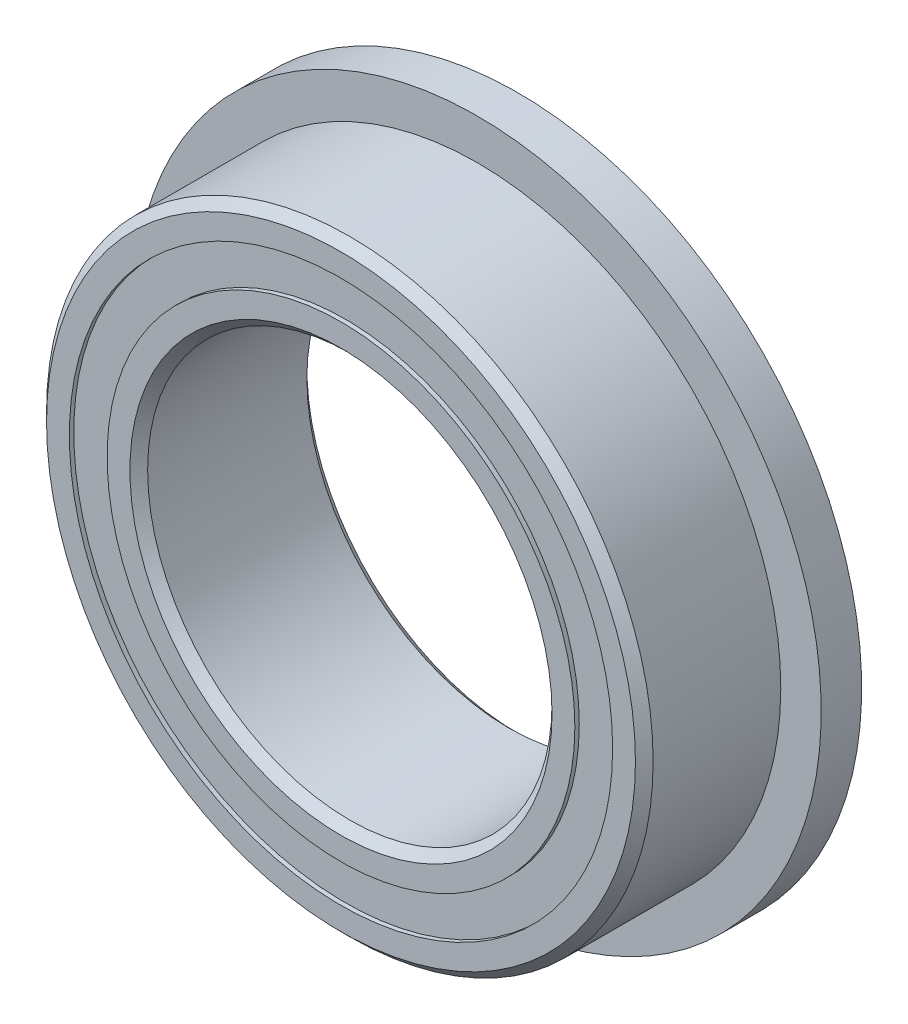
ISO-10303-21;
HEADER;
FILE_DESCRIPTION(('STEP AP214'),'2;1');
FILE_NAME('part.step','',(''),(''),'','','');
FILE_SCHEMA(('AUTOMOTIVE_DESIGN { 1 0 10303 214 1 1 1 1 }'));
ENDSEC;
DATA;
#1=APPLICATION_CONTEXT('core data for automotive mechanical design processes');
#2=APPLICATION_PROTOCOL_DEFINITION('international standard','automotive_design',2000,#1);
#3=PRODUCT_CONTEXT('',#1,'mechanical');
#4=PRODUCT('Part','Part','',(#3));
#5=PRODUCT_RELATED_PRODUCT_CATEGORY('part','',(#4));
#6=PRODUCT_DEFINITION_FORMATION('','',#4);
#7=PRODUCT_DEFINITION_CONTEXT('part definition',#1,'design');
#8=PRODUCT_DEFINITION('design','',#6,#7);
#9=PRODUCT_DEFINITION_SHAPE('','',#8);
#10=(LENGTH_UNIT() NAMED_UNIT(*) SI_UNIT(.MILLI.,.METRE.));
#11=(NAMED_UNIT(*) PLANE_ANGLE_UNIT() SI_UNIT($,.RADIAN.));
#12=(NAMED_UNIT(*) SI_UNIT($,.STERADIAN.) SOLID_ANGLE_UNIT());
#13=UNCERTAINTY_MEASURE_WITH_UNIT(LENGTH_MEASURE(1.E-05),#10,'distance_accuracy_value','');
#14=(GEOMETRIC_REPRESENTATION_CONTEXT(3) GLOBAL_UNCERTAINTY_ASSIGNED_CONTEXT((#13)) GLOBAL_UNIT_ASSIGNED_CONTEXT((#10,
#11,#12)) REPRESENTATION_CONTEXT('',''));
#15=CARTESIAN_POINT('',(0.,0.,0.));
#16=DIRECTION('',(0.,0.,1.));
#17=DIRECTION('',(1.,0.,0.));
#18=AXIS2_PLACEMENT_3D('',#15,#16,#17);
#19=CARTESIAN_POINT('',(0.,5.37362637362637,-1.6625));
#20=DIRECTION('',(0.,0.,1.));
#21=DIRECTION('',(1.,0.,0.));
#22=AXIS2_PLACEMENT_3D('',#19,#20,#21);
#23=PLANE('',#22);
#24=CARTESIAN_POINT('',(0.,0.,-1.6625));
#25=DIRECTION('',(0.,0.,1.));
#26=DIRECTION('',(1.,0.,0.));
#27=AXIS2_PLACEMENT_3D('',#24,#25,#26);
#28=CIRCLE('',#27,5.37362637362637);
#29=CARTESIAN_POINT('',(5.37362637362637,0.,-1.6625));
#30=VERTEX_POINT('',#29);
#31=EDGE_CURVE('E55',#30,#30,#28,.T.);
#32=ORIENTED_EDGE('',*,*,#31,.F.);
#33=EDGE_LOOP('',(#32));
#34=FACE_BOUND('',#33,.T.);
#35=CARTESIAN_POINT('',(0.,0.,-1.6625));
#36=DIRECTION('',(0.,0.,1.));
#37=DIRECTION('',(1.,0.,0.));
#38=AXIS2_PLACEMENT_3D('',#35,#36,#37);
#39=CIRCLE('',#38,4.62637362637363);
#40=CARTESIAN_POINT('',(4.62637362637363,0.,-1.6625));
#41=VERTEX_POINT('',#40);
#42=EDGE_CURVE('E11',#41,#41,#39,.T.);
#43=ORIENTED_EDGE('',*,*,#42,.T.);
#44=EDGE_LOOP('',(#43));
#45=FACE_BOUND('',#44,.T.);
#46=ADVANCED_FACE('F41',(#34,#45),#23,.F.);
#47=CARTESIAN_POINT('',(0.,0.,1.75));
#48=DIRECTION('',(0.,0.,1.));
#49=DIRECTION('',(1.,0.,0.));
#50=AXIS2_PLACEMENT_3D('',#47,#48,#49);
#51=CYLINDRICAL_SURFACE('',#50,4.62637362637363);
#52=ORIENTED_EDGE('',*,*,#42,.F.);
#53=EDGE_LOOP('',(#52));
#54=FACE_BOUND('',#53,.T.);
#55=CARTESIAN_POINT('',(0.,0.,-0.862864380232568));
#56=DIRECTION('',(0.,0.,1.));
#57=DIRECTION('',(1.,0.,0.));
#58=AXIS2_PLACEMENT_3D('',#55,#56,#57);
#59=CIRCLE('',#58,4.62637362637363);
#60=CARTESIAN_POINT('',(4.62637362637363,0.,-0.862864380232568));
#61=VERTEX_POINT('',#60);
#62=EDGE_CURVE('E47',#61,#61,#59,.T.);
#63=ORIENTED_EDGE('',*,*,#62,.T.);
#64=EDGE_LOOP('',(#63));
#65=FACE_BOUND('',#64,.T.);
#66=ADVANCED_FACE('F64',(#54,#65),#51,.F.);
#67=CARTESIAN_POINT('',(0.,5.37362637362637,-0.862864380232568));
#68=DIRECTION('',(0.,0.,-1.));
#69=DIRECTION('',(-1.,0.,0.));
#70=AXIS2_PLACEMENT_3D('',#67,#68,#69);
#71=PLANE('',#70);
#72=ORIENTED_EDGE('',*,*,#62,.F.);
#73=EDGE_LOOP('',(#72));
#74=FACE_BOUND('',#73,.T.);
#75=CARTESIAN_POINT('',(0.,0.,-0.862864380232568));
#76=DIRECTION('',(0.,0.,1.));
#77=DIRECTION('',(1.,0.,0.));
#78=AXIS2_PLACEMENT_3D('',#75,#76,#77);
#79=CIRCLE('',#78,5.37362637362637);
#80=CARTESIAN_POINT('',(5.37362637362637,0.,-0.862864380232568));
#81=VERTEX_POINT('',#80);
#82=EDGE_CURVE('E51',#81,#81,#79,.T.);
#83=ORIENTED_EDGE('',*,*,#82,.T.);
#84=EDGE_LOOP('',(#83));
#85=FACE_BOUND('',#84,.T.);
#86=ADVANCED_FACE('F68',(#74,#85),#71,.F.);
#87=CARTESIAN_POINT('',(0.,0.,1.75));
#88=DIRECTION('',(0.,0.,1.));
#89=DIRECTION('',(1.,0.,0.));
#90=AXIS2_PLACEMENT_3D('',#87,#88,#89);
#91=CYLINDRICAL_SURFACE('',#90,5.37362637362637);
#92=ORIENTED_EDGE('',*,*,#82,.F.);
#93=EDGE_LOOP('',(#92));
#94=FACE_BOUND('',#93,.T.);
#95=ORIENTED_EDGE('',*,*,#31,.T.);
#96=EDGE_LOOP('',(#95));
#97=FACE_BOUND('',#96,.T.);
#98=ADVANCED_FACE('F61',(#94,#97),#91,.T.);
#99=CLOSED_SHELL('',(#46,#66,#86,#98));
#100=MANIFOLD_SOLID_BREP('B2',#99);
#101=CARTESIAN_POINT('',(0.,5.37362637362637,1.6625));
#102=DIRECTION('',(0.,0.,-1.));
#103=DIRECTION('',(-1.,0.,0.));
#104=AXIS2_PLACEMENT_3D('',#101,#102,#103);
#105=PLANE('',#104);
#106=CARTESIAN_POINT('',(0.,0.,1.6625));
#107=DIRECTION('',(0.,0.,1.));
#108=DIRECTION('',(1.,0.,0.));
#109=AXIS2_PLACEMENT_3D('',#106,#107,#108);
#110=CIRCLE('',#109,4.62637362637363);
#111=CARTESIAN_POINT('',(4.62637362637363,0.,1.6625));
#112=VERTEX_POINT('',#111);
#113=EDGE_CURVE('E40',#112,#112,#110,.T.);
#114=ORIENTED_EDGE('',*,*,#113,.F.);
#115=EDGE_LOOP('',(#114));
#116=FACE_BOUND('',#115,.T.);
#117=CARTESIAN_POINT('',(0.,0.,1.6625));
#118=DIRECTION('',(0.,0.,1.));
#119=DIRECTION('',(1.,0.,0.));
#120=AXIS2_PLACEMENT_3D('',#117,#118,#119);
#121=CIRCLE('',#120,5.37362637362637);
#122=CARTESIAN_POINT('',(5.37362637362637,0.,1.6625));
#123=VERTEX_POINT('',#122);
#124=EDGE_CURVE('E122',#123,#123,#121,.T.);
#125=ORIENTED_EDGE('',*,*,#124,.T.);
#126=EDGE_LOOP('',(#125));
#127=FACE_BOUND('',#126,.T.);
#128=ADVANCED_FACE('F108',(#116,#127),#105,.F.);
#129=CARTESIAN_POINT('',(0.,0.,1.75));
#130=DIRECTION('',(0.,0.,1.));
#131=DIRECTION('',(1.,0.,0.));
#132=AXIS2_PLACEMENT_3D('',#129,#130,#131);
#133=CYLINDRICAL_SURFACE('',#132,4.62637362637363);
#134=CARTESIAN_POINT('',(0.,0.,0.862864380232567));
#135=DIRECTION('',(0.,0.,1.));
#136=DIRECTION('',(1.,0.,0.));
#137=AXIS2_PLACEMENT_3D('',#134,#135,#136);
#138=CIRCLE('',#137,4.62637362637363);
#139=CARTESIAN_POINT('',(4.62637362637363,0.,0.862864380232567));
#140=VERTEX_POINT('',#139);
#141=EDGE_CURVE('E114',#140,#140,#138,.T.);
#142=ORIENTED_EDGE('',*,*,#141,.F.);
#143=EDGE_LOOP('',(#142));
#144=FACE_BOUND('',#143,.T.);
#145=ORIENTED_EDGE('',*,*,#113,.T.);
#146=EDGE_LOOP('',(#145));
#147=FACE_BOUND('',#146,.T.);
#148=ADVANCED_FACE('F137',(#144,#147),#133,.F.);
#149=CARTESIAN_POINT('',(0.,5.37362637362637,0.862864380232567));
#150=DIRECTION('',(0.,0.,1.));
#151=DIRECTION('',(1.,0.,0.));
#152=AXIS2_PLACEMENT_3D('',#149,#150,#151);
#153=PLANE('',#152);
#154=CARTESIAN_POINT('',(0.,0.,0.862864380232567));
#155=DIRECTION('',(0.,0.,1.));
#156=DIRECTION('',(1.,0.,0.));
#157=AXIS2_PLACEMENT_3D('',#154,#155,#156);
#158=CIRCLE('',#157,5.37362637362637);
#159=CARTESIAN_POINT('',(5.37362637362637,0.,0.862864380232567));
#160=VERTEX_POINT('',#159);
#161=EDGE_CURVE('E118',#160,#160,#158,.T.);
#162=ORIENTED_EDGE('',*,*,#161,.F.);
#163=EDGE_LOOP('',(#162));
#164=FACE_BOUND('',#163,.T.);
#165=ORIENTED_EDGE('',*,*,#141,.T.);
#166=EDGE_LOOP('',(#165));
#167=FACE_BOUND('',#166,.T.);
#168=ADVANCED_FACE('F132',(#164,#167),#153,.F.);
#169=CARTESIAN_POINT('',(0.,0.,1.75));
#170=DIRECTION('',(0.,0.,1.));
#171=DIRECTION('',(1.,0.,0.));
#172=AXIS2_PLACEMENT_3D('',#169,#170,#171);
#173=CYLINDRICAL_SURFACE('',#172,5.37362637362637);
#174=ORIENTED_EDGE('',*,*,#124,.F.);
#175=EDGE_LOOP('',(#174));
#176=FACE_BOUND('',#175,.T.);
#177=ORIENTED_EDGE('',*,*,#161,.T.);
#178=EDGE_LOOP('',(#177));
#179=FACE_BOUND('',#178,.T.);
#180=ADVANCED_FACE('F129',(#176,#179),#173,.T.);
#181=CLOSED_SHELL('',(#128,#148,#168,#180));
#182=MANIFOLD_SOLID_BREP('B6',#181);
#183=CARTESIAN_POINT('',(-2.49999999999994,4.33012701892223,0.));
#184=DIRECTION('',(0.,0.,1.));
#185=DIRECTION('',(0.499999999999989,-0.866025403784445,0.));
#186=AXIS2_PLACEMENT_3D('',#183,#184,#185);
#187=SPHERICAL_SURFACE('',#186,0.862864380232568);
#188=CARTESIAN_POINT('',(-2.49999999999994,4.33012701892223,0.862864380232567));
#189=VERTEX_POINT('',#188);
#190=VERTEX_LOOP('',#189);
#191=FACE_BOUND('',#190,.T.);
#192=ADVANCED_FACE('F175',(#191),#187,.T.);
#193=CLOSED_SHELL('',(#192));
#194=MANIFOLD_SOLID_BREP('B35',#193);
#195=CARTESIAN_POINT('',(-4.33012701892216,2.50000000000005,0.));
#196=DIRECTION('',(0.,0.,1.));
#197=DIRECTION('',(0.866025403784433,-0.50000000000001,0.));
#198=AXIS2_PLACEMENT_3D('',#195,#196,#197);
#199=SPHERICAL_SURFACE('',#198,0.862864380232568);
#200=CARTESIAN_POINT('',(-4.33012701892216,2.50000000000005,0.862864380232567));
#201=VERTEX_POINT('',#200);
#202=VERTEX_LOOP('',#201);
#203=FACE_BOUND('',#202,.T.);
#204=ADVANCED_FACE('F195',(#203),#199,.T.);
#205=CLOSED_SHELL('',(#204));
#206=MANIFOLD_SOLID_BREP('B104',#205);
#207=CARTESIAN_POINT('',(-5.,0.,0.));
#208=DIRECTION('',(0.,0.,1.));
#209=DIRECTION('',(1.,0.,0.));
#210=AXIS2_PLACEMENT_3D('',#207,#208,#209);
#211=SPHERICAL_SURFACE('',#210,0.862864380232568);
#212=CARTESIAN_POINT('',(-5.,0.,0.862864380232567));
#213=VERTEX_POINT('',#212);
#214=VERTEX_LOOP('',#213);
#215=FACE_BOUND('',#214,.T.);
#216=ADVANCED_FACE('F215',(#215),#211,.T.);
#217=CLOSED_SHELL('',(#216));
#218=MANIFOLD_SOLID_BREP('B171',#217);
#219=CARTESIAN_POINT('',(-4.33012701892222,-2.49999999999996,0.));
#220=DIRECTION('',(0.,0.,1.));
#221=DIRECTION('',(0.866025403784443,0.499999999999992,0.));
#222=AXIS2_PLACEMENT_3D('',#219,#220,#221);
#223=SPHERICAL_SURFACE('',#222,0.862864380232568);
#224=CARTESIAN_POINT('',(-4.33012701892222,-2.49999999999996,0.862864380232567));
#225=VERTEX_POINT('',#224);
#226=VERTEX_LOOP('',#225);
#227=FACE_BOUND('',#226,.T.);
#228=ADVANCED_FACE('F235',(#227),#223,.T.);
#229=CLOSED_SHELL('',(#228));
#230=MANIFOLD_SOLID_BREP('B191',#229);
#231=CARTESIAN_POINT('',(-2.50000000000004,-4.33012701892217,0.));
#232=DIRECTION('',(0.,0.,1.));
#233=DIRECTION('',(0.500000000000007,0.866025403784435,0.));
#234=AXIS2_PLACEMENT_3D('',#231,#232,#233);
#235=SPHERICAL_SURFACE('',#234,0.862864380232568);
#236=CARTESIAN_POINT('',(-2.50000000000004,-4.33012701892217,0.862864380232567));
#237=VERTEX_POINT('',#236);
#238=VERTEX_LOOP('',#237);
#239=FACE_BOUND('',#238,.T.);
#240=ADVANCED_FACE('F255',(#239),#235,.T.);
#241=CLOSED_SHELL('',(#240));
#242=MANIFOLD_SOLID_BREP('B211',#241);
#243=CARTESIAN_POINT('',(0.,-5.,0.));
#244=DIRECTION('',(0.,0.,1.));
#245=DIRECTION('',(0.,1.,0.));
#246=AXIS2_PLACEMENT_3D('',#243,#244,#245);
#247=SPHERICAL_SURFACE('',#246,0.862864380232568);
#248=CARTESIAN_POINT('',(0.,-5.,0.862864380232567));
#249=VERTEX_POINT('',#248);
#250=VERTEX_LOOP('',#249);
#251=FACE_BOUND('',#250,.T.);
#252=ADVANCED_FACE('F275',(#251),#247,.T.);
#253=CLOSED_SHELL('',(#252));
#254=MANIFOLD_SOLID_BREP('B231',#253);
#255=CARTESIAN_POINT('',(2.49999999999997,-4.33012701892221,0.));
#256=DIRECTION('',(0.,0.,1.));
#257=DIRECTION('',(-0.499999999999995,0.866025403784442,0.));
#258=AXIS2_PLACEMENT_3D('',#255,#256,#257);
#259=SPHERICAL_SURFACE('',#258,0.862864380232568);
#260=CARTESIAN_POINT('',(2.49999999999997,-4.33012701892221,0.862864380232567));
#261=VERTEX_POINT('',#260);
#262=VERTEX_LOOP('',#261);
#263=FACE_BOUND('',#262,.T.);
#264=ADVANCED_FACE('F295',(#263),#259,.T.);
#265=CLOSED_SHELL('',(#264));
#266=MANIFOLD_SOLID_BREP('B251',#265);
#267=CARTESIAN_POINT('',(4.33012701892218,-2.50000000000002,0.));
#268=DIRECTION('',(0.,0.,1.));
#269=DIRECTION('',(-0.866025403784436,0.500000000000004,0.));
#270=AXIS2_PLACEMENT_3D('',#267,#268,#269);
#271=SPHERICAL_SURFACE('',#270,0.862864380232568);
#272=CARTESIAN_POINT('',(4.33012701892218,-2.50000000000002,0.862864380232567));
#273=VERTEX_POINT('',#272);
#274=VERTEX_LOOP('',#273);
#275=FACE_BOUND('',#274,.T.);
#276=ADVANCED_FACE('F315',(#275),#271,.T.);
#277=CLOSED_SHELL('',(#276));
#278=MANIFOLD_SOLID_BREP('B271',#277);
#279=CARTESIAN_POINT('',(5.,0.,0.));
#280=DIRECTION('',(0.,0.,1.));
#281=DIRECTION('',(-1.,0.,0.));
#282=AXIS2_PLACEMENT_3D('',#279,#280,#281);
#283=SPHERICAL_SURFACE('',#282,0.862864380232568);
#284=CARTESIAN_POINT('',(5.,0.,0.862864380232567));
#285=VERTEX_POINT('',#284);
#286=VERTEX_LOOP('',#285);
#287=FACE_BOUND('',#286,.T.);
#288=ADVANCED_FACE('F335',(#287),#283,.T.);
#289=CLOSED_SHELL('',(#288));
#290=MANIFOLD_SOLID_BREP('B291',#289);
#291=CARTESIAN_POINT('',(4.3301270189222,2.49999999999999,0.));
#292=DIRECTION('',(0.,0.,1.));
#293=DIRECTION('',(-0.86602540378444,-0.499999999999998,0.));
#294=AXIS2_PLACEMENT_3D('',#291,#292,#293);
#295=SPHERICAL_SURFACE('',#294,0.862864380232568);
#296=CARTESIAN_POINT('',(4.3301270189222,2.49999999999999,0.862864380232567));
#297=VERTEX_POINT('',#296);
#298=VERTEX_LOOP('',#297);
#299=FACE_BOUND('',#298,.T.);
#300=ADVANCED_FACE('F355',(#299),#295,.T.);
#301=CLOSED_SHELL('',(#300));
#302=MANIFOLD_SOLID_BREP('B311',#301);
#303=CARTESIAN_POINT('',(2.50000000000001,4.33012701892219,0.));
#304=DIRECTION('',(0.,0.,1.));
#305=DIRECTION('',(-0.500000000000001,-0.866025403784438,0.));
#306=AXIS2_PLACEMENT_3D('',#303,#304,#305);
#307=SPHERICAL_SURFACE('',#306,0.862864380232568);
#308=CARTESIAN_POINT('',(2.50000000000001,4.33012701892219,0.862864380232567));
#309=VERTEX_POINT('',#308);
#310=VERTEX_LOOP('',#309);
#311=FACE_BOUND('',#310,.T.);
#312=ADVANCED_FACE('F375',(#311),#307,.T.);
#313=CLOSED_SHELL('',(#312));
#314=MANIFOLD_SOLID_BREP('B331',#313);
#315=CARTESIAN_POINT('',(0.,5.,0.));
#316=DIRECTION('',(0.,0.,1.));
#317=DIRECTION('',(0.,-1.,0.));
#318=AXIS2_PLACEMENT_3D('',#315,#316,#317);
#319=SPHERICAL_SURFACE('',#318,0.862864380232568);
#320=CARTESIAN_POINT('',(0.,5.,0.862864380232567));
#321=VERTEX_POINT('',#320);
#322=VERTEX_LOOP('',#321);
#323=FACE_BOUND('',#322,.T.);
#324=ADVANCED_FACE('F397',(#323),#319,.T.);
#325=CLOSED_SHELL('',(#324));
#326=MANIFOLD_SOLID_BREP('B351',#325);
#327=CARTESIAN_POINT('',(0.,4.62637362637363,1.75));
#328=DIRECTION('',(0.,0.,-1.));
#329=DIRECTION('',(-1.,0.,0.));
#330=AXIS2_PLACEMENT_3D('',#327,#328,#329);
#331=PLANE('',#330);
#332=CARTESIAN_POINT('',(0.,0.,1.75));
#333=DIRECTION('',(0.,0.,1.));
#334=DIRECTION('',(1.,0.,0.));
#335=AXIS2_PLACEMENT_3D('',#332,#333,#334);
#336=CIRCLE('',#335,4.175);
#337=CARTESIAN_POINT('',(4.175,0.,1.75));
#338=VERTEX_POINT('',#337);
#339=EDGE_CURVE('E444',#338,#338,#336,.T.);
#340=ORIENTED_EDGE('',*,*,#339,.F.);
#341=EDGE_LOOP('',(#340));
#342=FACE_BOUND('',#341,.T.);
#343=CARTESIAN_POINT('',(0.,0.,1.75));
#344=DIRECTION('',(0.,0.,1.));
#345=DIRECTION('',(1.,0.,0.));
#346=AXIS2_PLACEMENT_3D('',#343,#344,#345);
#347=CIRCLE('',#346,4.62637362637363);
#348=CARTESIAN_POINT('',(4.62637362637363,0.,1.75));
#349=VERTEX_POINT('',#348);
#350=EDGE_CURVE('E396',#349,#349,#347,.T.);
#351=ORIENTED_EDGE('',*,*,#350,.T.);
#352=EDGE_LOOP('',(#351));
#353=FACE_BOUND('',#352,.T.);
#354=ADVANCED_FACE('F416',(#342,#353),#331,.F.);
#355=CARTESIAN_POINT('',(0.,0.,1.75));
#356=DIRECTION('',(0.,0.,1.));
#357=DIRECTION('',(1.,0.,0.));
#358=AXIS2_PLACEMENT_3D('',#355,#356,#357);
#359=CYLINDRICAL_SURFACE('',#358,4.62637362637363);
#360=ORIENTED_EDGE('',*,*,#350,.F.);
#361=EDGE_LOOP('',(#360));
#362=FACE_BOUND('',#361,.T.);
#363=CARTESIAN_POINT('',(0.,0.,0.777777777777777));
#364=DIRECTION('',(0.,0.,1.));
#365=DIRECTION('',(1.,0.,0.));
#366=AXIS2_PLACEMENT_3D('',#363,#364,#365);
#367=CIRCLE('',#366,4.62637362637363);
#368=CARTESIAN_POINT('',(4.62637362637363,0.,0.777777777777777));
#369=VERTEX_POINT('',#368);
#370=EDGE_CURVE('E422',#369,#369,#367,.T.);
#371=ORIENTED_EDGE('',*,*,#370,.T.);
#372=EDGE_LOOP('',(#371));
#373=FACE_BOUND('',#372,.T.);
#374=ADVANCED_FACE('F451',(#362,#373),#359,.T.);
#375=CARTESIAN_POINT('',(0.,0.,0.));
#376=DIRECTION('',(0.,0.,1.));
#377=DIRECTION('',(1.,0.,0.));
#378=AXIS2_PLACEMENT_3D('',#375,#376,#377);
#379=TOROIDAL_SURFACE('',#378,5.,0.862864380232566);
#380=ORIENTED_EDGE('',*,*,#370,.F.);
#381=EDGE_LOOP('',(#380));
#382=FACE_BOUND('',#381,.T.);
#383=CARTESIAN_POINT('',(0.,0.,-0.777777777777779));
#384=DIRECTION('',(0.,0.,1.));
#385=DIRECTION('',(1.,0.,0.));
#386=AXIS2_PLACEMENT_3D('',#383,#384,#385);
#387=CIRCLE('',#386,4.62637362637362);
#388=CARTESIAN_POINT('',(4.62637362637362,0.,-0.777777777777779));
#389=VERTEX_POINT('',#388);
#390=EDGE_CURVE('E426',#389,#389,#387,.T.);
#391=ORIENTED_EDGE('',*,*,#390,.T.);
#392=EDGE_LOOP('',(#391));
#393=FACE_BOUND('',#392,.T.);
#394=ADVANCED_FACE('F455',(#382,#393),#379,.F.);
#395=CARTESIAN_POINT('',(0.,0.,1.75));
#396=DIRECTION('',(0.,0.,1.));
#397=DIRECTION('',(1.,0.,0.));
#398=AXIS2_PLACEMENT_3D('',#395,#396,#397);
#399=CYLINDRICAL_SURFACE('',#398,4.62637362637362);
#400=ORIENTED_EDGE('',*,*,#390,.F.);
#401=EDGE_LOOP('',(#400));
#402=FACE_BOUND('',#401,.T.);
#403=CARTESIAN_POINT('',(0.,0.,-1.75));
#404=DIRECTION('',(0.,0.,1.));
#405=DIRECTION('',(1.,0.,0.));
#406=AXIS2_PLACEMENT_3D('',#403,#404,#405);
#407=CIRCLE('',#406,4.62637362637363);
#408=CARTESIAN_POINT('',(4.62637362637363,0.,-1.75));
#409=VERTEX_POINT('',#408);
#410=EDGE_CURVE('E430',#409,#409,#407,.T.);
#411=ORIENTED_EDGE('',*,*,#410,.T.);
#412=EDGE_LOOP('',(#411));
#413=FACE_BOUND('',#412,.T.);
#414=ADVANCED_FACE('F460',(#402,#413),#399,.T.);
#415=CARTESIAN_POINT('',(0.,4.175,-1.75));
#416=DIRECTION('',(0.,0.,1.));
#417=DIRECTION('',(1.,0.,0.));
#418=AXIS2_PLACEMENT_3D('',#415,#416,#417);
#419=PLANE('',#418);
#420=ORIENTED_EDGE('',*,*,#410,.F.);
#421=EDGE_LOOP('',(#420));
#422=FACE_BOUND('',#421,.T.);
#423=CARTESIAN_POINT('',(0.,0.,-1.75));
#424=DIRECTION('',(0.,0.,1.));
#425=DIRECTION('',(1.,0.,0.));
#426=AXIS2_PLACEMENT_3D('',#423,#424,#425);
#427=CIRCLE('',#426,4.175);
#428=CARTESIAN_POINT('',(4.175,0.,-1.75));
#429=VERTEX_POINT('',#428);
#430=EDGE_CURVE('E435',#429,#429,#427,.T.);
#431=ORIENTED_EDGE('',*,*,#430,.T.);
#432=EDGE_LOOP('',(#431));
#433=FACE_BOUND('',#432,.T.);
#434=ADVANCED_FACE('F466',(#422,#433),#419,.F.);
#435=CARTESIAN_POINT('',(0.,0.,-1.575));
#436=DIRECTION('',(0.,0.,-1.));
#437=DIRECTION('',(-1.,0.,0.));
#438=AXIS2_PLACEMENT_3D('',#435,#436,#437);
#439=CONICAL_SURFACE('',#438,4.,0.785398163397448);
#440=ORIENTED_EDGE('',*,*,#430,.F.);
#441=EDGE_LOOP('',(#440));
#442=FACE_BOUND('',#441,.T.);
#443=CARTESIAN_POINT('',(0.,0.,-1.575));
#444=DIRECTION('',(0.,0.,1.));
#445=DIRECTION('',(1.,0.,0.));
#446=AXIS2_PLACEMENT_3D('',#443,#444,#445);
#447=CIRCLE('',#446,4.);
#448=CARTESIAN_POINT('',(4.,0.,-1.575));
#449=VERTEX_POINT('',#448);
#450=EDGE_CURVE('E438',#449,#449,#447,.T.);
#451=ORIENTED_EDGE('',*,*,#450,.T.);
#452=EDGE_LOOP('',(#451));
#453=FACE_BOUND('',#452,.T.);
#454=ADVANCED_FACE('F470',(#442,#453),#439,.F.);
#455=CARTESIAN_POINT('',(0.,0.,1.75));
#456=DIRECTION('',(0.,0.,1.));
#457=DIRECTION('',(1.,0.,0.));
#458=AXIS2_PLACEMENT_3D('',#455,#456,#457);
#459=CYLINDRICAL_SURFACE('',#458,4.);
#460=ORIENTED_EDGE('',*,*,#450,.F.);
#461=EDGE_LOOP('',(#460));
#462=FACE_BOUND('',#461,.T.);
#463=CARTESIAN_POINT('',(0.,0.,1.575));
#464=DIRECTION('',(0.,0.,1.));
#465=DIRECTION('',(1.,0.,0.));
#466=AXIS2_PLACEMENT_3D('',#463,#464,#465);
#467=CIRCLE('',#466,4.);
#468=CARTESIAN_POINT('',(4.,0.,1.575));
#469=VERTEX_POINT('',#468);
#470=EDGE_CURVE('E441',#469,#469,#467,.T.);
#471=ORIENTED_EDGE('',*,*,#470,.T.);
#472=EDGE_LOOP('',(#471));
#473=FACE_BOUND('',#472,.T.);
#474=ADVANCED_FACE('F474',(#462,#473),#459,.F.);
#475=CARTESIAN_POINT('',(0.,0.,1.75));
#476=DIRECTION('',(0.,0.,1.));
#477=DIRECTION('',(1.,0.,0.));
#478=AXIS2_PLACEMENT_3D('',#475,#476,#477);
#479=CONICAL_SURFACE('',#478,4.175,0.785398163397447);
#480=ORIENTED_EDGE('',*,*,#470,.F.);
#481=EDGE_LOOP('',(#480));
#482=FACE_BOUND('',#481,.T.);
#483=ORIENTED_EDGE('',*,*,#339,.T.);
#484=EDGE_LOOP('',(#483));
#485=FACE_BOUND('',#484,.T.);
#486=ADVANCED_FACE('F448',(#482,#485),#479,.F.);
#487=CLOSED_SHELL('',(#354,#374,#394,#414,#434,#454,#474,#486));
#488=MANIFOLD_SOLID_BREP('B371',#487);
#489=CARTESIAN_POINT('',(0.,0.,1.575));
#490=DIRECTION('',(0.,0.,-1.));
#491=DIRECTION('',(-1.,0.,0.));
#492=AXIS2_PLACEMENT_3D('',#489,#490,#491);
#493=CONICAL_SURFACE('',#492,6.,0.78539816339745);
#494=CARTESIAN_POINT('',(0.,0.,1.75));
#495=DIRECTION('',(0.,0.,1.));
#496=DIRECTION('',(1.,0.,0.));
#497=AXIS2_PLACEMENT_3D('',#494,#495,#496);
#498=CIRCLE('',#497,5.825);
#499=CARTESIAN_POINT('',(5.825,0.,1.75));
#500=VERTEX_POINT('',#499);
#501=EDGE_CURVE('E559',#500,#500,#498,.T.);
#502=ORIENTED_EDGE('',*,*,#501,.F.);
#503=EDGE_LOOP('',(#502));
#504=FACE_BOUND('',#503,.T.);
#505=CARTESIAN_POINT('',(0.,0.,1.575));
#506=DIRECTION('',(0.,0.,1.));
#507=DIRECTION('',(1.,0.,0.));
#508=AXIS2_PLACEMENT_3D('',#505,#506,#507);
#509=CIRCLE('',#508,6.);
#510=CARTESIAN_POINT('',(6.,0.,1.575));
#511=VERTEX_POINT('',#510);
#512=EDGE_CURVE('E415',#511,#511,#509,.T.);
#513=ORIENTED_EDGE('',*,*,#512,.T.);
#514=EDGE_LOOP('',(#513));
#515=FACE_BOUND('',#514,.T.);
#516=ADVANCED_FACE('F537',(#504,#515),#493,.T.);
#517=CARTESIAN_POINT('',(0.,0.,1.75));
#518=DIRECTION('',(0.,0.,1.));
#519=DIRECTION('',(1.,0.,0.));
#520=AXIS2_PLACEMENT_3D('',#517,#518,#519);
#521=CYLINDRICAL_SURFACE('',#520,6.);
#522=CARTESIAN_POINT('',(0.,0.,-0.95));
#523=DIRECTION('',(0.,0.,1.));
#524=DIRECTION('',(1.,0.,0.));
#525=AXIS2_PLACEMENT_3D('',#522,#523,#524);
#526=CIRCLE('',#525,6.);
#527=CARTESIAN_POINT('',(6.,0.,-0.95));
#528=VERTEX_POINT('',#527);
#529=EDGE_CURVE('E562',#528,#528,#526,.T.);
#530=ORIENTED_EDGE('',*,*,#529,.T.);
#531=EDGE_LOOP('',(#530));
#532=FACE_BOUND('',#531,.T.);
#533=ORIENTED_EDGE('',*,*,#512,.F.);
#534=EDGE_LOOP('',(#533));
#535=FACE_BOUND('',#534,.T.);
#536=ADVANCED_FACE('F582',(#532,#535),#521,.T.);
#537=CARTESIAN_POINT('',(0.,5.825,-1.75));
#538=DIRECTION('',(0.,0.,1.));
#539=DIRECTION('',(1.,0.,0.));
#540=AXIS2_PLACEMENT_3D('',#537,#538,#539);
#541=PLANE('',#540);
#542=CARTESIAN_POINT('',(0.,0.,-1.75));
#543=DIRECTION('',(0.,0.,1.));
#544=DIRECTION('',(1.,0.,0.));
#545=AXIS2_PLACEMENT_3D('',#542,#543,#544);
#546=CIRCLE('',#545,5.37362637362637);
#547=CARTESIAN_POINT('',(5.37362637362637,0.,-1.75));
#548=VERTEX_POINT('',#547);
#549=EDGE_CURVE('E543',#548,#548,#546,.T.);
#550=ORIENTED_EDGE('',*,*,#549,.T.);
#551=EDGE_LOOP('',(#550));
#552=FACE_BOUND('',#551,.T.);
#553=CARTESIAN_POINT('',(0.,0.,-1.75));
#554=DIRECTION('',(0.,0.,-1.));
#555=DIRECTION('',(-1.,0.,0.));
#556=AXIS2_PLACEMENT_3D('',#553,#554,#555);
#557=CIRCLE('',#556,6.8);
#558=CARTESIAN_POINT('',(-6.8,0.,-1.75));
#559=VERTEX_POINT('',#558);
#560=EDGE_CURVE('E565',#559,#559,#557,.T.);
#561=ORIENTED_EDGE('',*,*,#560,.T.);
#562=EDGE_LOOP('',(#561));
#563=FACE_BOUND('',#562,.T.);
#564=ADVANCED_FACE('F585',(#552,#563),#541,.F.);
#565=CARTESIAN_POINT('',(0.,0.,1.75));
#566=DIRECTION('',(0.,0.,1.));
#567=DIRECTION('',(1.,0.,0.));
#568=AXIS2_PLACEMENT_3D('',#565,#566,#567);
#569=CYLINDRICAL_SURFACE('',#568,5.37362637362637);
#570=CARTESIAN_POINT('',(0.,0.,-0.777777777777778));
#571=DIRECTION('',(0.,0.,1.));
#572=DIRECTION('',(1.,0.,0.));
#573=AXIS2_PLACEMENT_3D('',#570,#571,#572);
#574=CIRCLE('',#573,5.37362637362637);
#575=CARTESIAN_POINT('',(5.37362637362637,0.,-0.777777777777778));
#576=VERTEX_POINT('',#575);
#577=EDGE_CURVE('E547',#576,#576,#574,.T.);
#578=ORIENTED_EDGE('',*,*,#577,.T.);
#579=EDGE_LOOP('',(#578));
#580=FACE_BOUND('',#579,.T.);
#581=ORIENTED_EDGE('',*,*,#549,.F.);
#582=EDGE_LOOP('',(#581));
#583=FACE_BOUND('',#582,.T.);
#584=ADVANCED_FACE('F590',(#580,#583),#569,.F.);
#585=CARTESIAN_POINT('',(0.,0.,0.));
#586=DIRECTION('',(0.,0.,1.));
#587=DIRECTION('',(1.,0.,0.));
#588=AXIS2_PLACEMENT_3D('',#585,#586,#587);
#589=TOROIDAL_SURFACE('',#588,5.,0.862864380232568);
#590=ORIENTED_EDGE('',*,*,#577,.F.);
#591=EDGE_LOOP('',(#590));
#592=FACE_BOUND('',#591,.T.);
#593=CARTESIAN_POINT('',(0.,0.,0.777777777777777));
#594=DIRECTION('',(0.,0.,1.));
#595=DIRECTION('',(1.,0.,0.));
#596=AXIS2_PLACEMENT_3D('',#593,#594,#595);
#597=CIRCLE('',#596,5.37362637362637);
#598=CARTESIAN_POINT('',(5.37362637362637,0.,0.777777777777777));
#599=VERTEX_POINT('',#598);
#600=EDGE_CURVE('E551',#599,#599,#597,.T.);
#601=ORIENTED_EDGE('',*,*,#600,.T.);
#602=EDGE_LOOP('',(#601));
#603=FACE_BOUND('',#602,.T.);
#604=ADVANCED_FACE('F596',(#592,#603),#589,.F.);
#605=CARTESIAN_POINT('',(0.,0.,1.75));
#606=DIRECTION('',(0.,0.,1.));
#607=DIRECTION('',(1.,0.,0.));
#608=AXIS2_PLACEMENT_3D('',#605,#606,#607);
#609=CYLINDRICAL_SURFACE('',#608,5.37362637362637);
#610=ORIENTED_EDGE('',*,*,#600,.F.);
#611=EDGE_LOOP('',(#610));
#612=FACE_BOUND('',#611,.T.);
#613=CARTESIAN_POINT('',(0.,0.,1.75));
#614=DIRECTION('',(0.,0.,1.));
#615=DIRECTION('',(1.,0.,0.));
#616=AXIS2_PLACEMENT_3D('',#613,#614,#615);
#617=CIRCLE('',#616,5.37362637362637);
#618=CARTESIAN_POINT('',(5.37362637362637,0.,1.75));
#619=VERTEX_POINT('',#618);
#620=EDGE_CURVE('E556',#619,#619,#617,.T.);
#621=ORIENTED_EDGE('',*,*,#620,.T.);
#622=EDGE_LOOP('',(#621));
#623=FACE_BOUND('',#622,.T.);
#624=ADVANCED_FACE('F600',(#612,#623),#609,.F.);
#625=CARTESIAN_POINT('',(0.,5.825,1.75));
#626=DIRECTION('',(0.,0.,-1.));
#627=DIRECTION('',(-1.,0.,0.));
#628=AXIS2_PLACEMENT_3D('',#625,#626,#627);
#629=PLANE('',#628);
#630=ORIENTED_EDGE('',*,*,#620,.F.);
#631=EDGE_LOOP('',(#630));
#632=FACE_BOUND('',#631,.T.);
#633=ORIENTED_EDGE('',*,*,#501,.T.);
#634=EDGE_LOOP('',(#633));
#635=FACE_BOUND('',#634,.T.);
#636=ADVANCED_FACE('F578',(#632,#635),#629,.F.);
#637=CARTESIAN_POINT('',(0.,5.37362637362637,-0.95));
#638=DIRECTION('',(0.,0.,1.));
#639=DIRECTION('',(1.,0.,0.));
#640=AXIS2_PLACEMENT_3D('',#637,#638,#639);
#641=PLANE('',#640);
#642=CARTESIAN_POINT('',(0.,0.,-0.95));
#643=DIRECTION('',(0.,0.,-1.));
#644=DIRECTION('',(-1.,0.,0.));
#645=AXIS2_PLACEMENT_3D('',#642,#643,#644);
#646=CIRCLE('',#645,6.8);
#647=CARTESIAN_POINT('',(-6.8,0.,-0.95));
#648=VERTEX_POINT('',#647);
#649=EDGE_CURVE('E568',#648,#648,#646,.T.);
#650=ORIENTED_EDGE('',*,*,#649,.F.);
#651=EDGE_LOOP('',(#650));
#652=FACE_BOUND('',#651,.T.);
#653=ORIENTED_EDGE('',*,*,#529,.F.);
#654=EDGE_LOOP('',(#653));
#655=FACE_BOUND('',#654,.T.);
#656=ADVANCED_FACE('F575',(#652,#655),#641,.T.);
#657=CARTESIAN_POINT('',(0.,0.,-1.75));
#658=DIRECTION('',(0.,0.,-1.));
#659=DIRECTION('',(-1.,0.,0.));
#660=AXIS2_PLACEMENT_3D('',#657,#658,#659);
#661=CYLINDRICAL_SURFACE('',#660,6.8);
#662=ORIENTED_EDGE('',*,*,#649,.T.);
#663=EDGE_LOOP('',(#662));
#664=FACE_BOUND('',#663,.T.);
#665=ORIENTED_EDGE('',*,*,#560,.F.);
#666=EDGE_LOOP('',(#665));
#667=FACE_BOUND('',#666,.T.);
#668=ADVANCED_FACE('F572',(#664,#667),#661,.T.);
#669=CLOSED_SHELL('',(#516,#536,#564,#584,#604,#624,#636,#656,#668));
#670=MANIFOLD_SOLID_BREP('B391',#669);
#671=ADVANCED_BREP_SHAPE_REPRESENTATION('',(#18,#100,#182,#194,#206,#218,#230,#242,#254,#266,
#278,#290,#302,#314,#326,#488,#670),#14);
#672=SHAPE_DEFINITION_REPRESENTATION(#9,#671);
ENDSEC;
END-ISO-10303-21;
